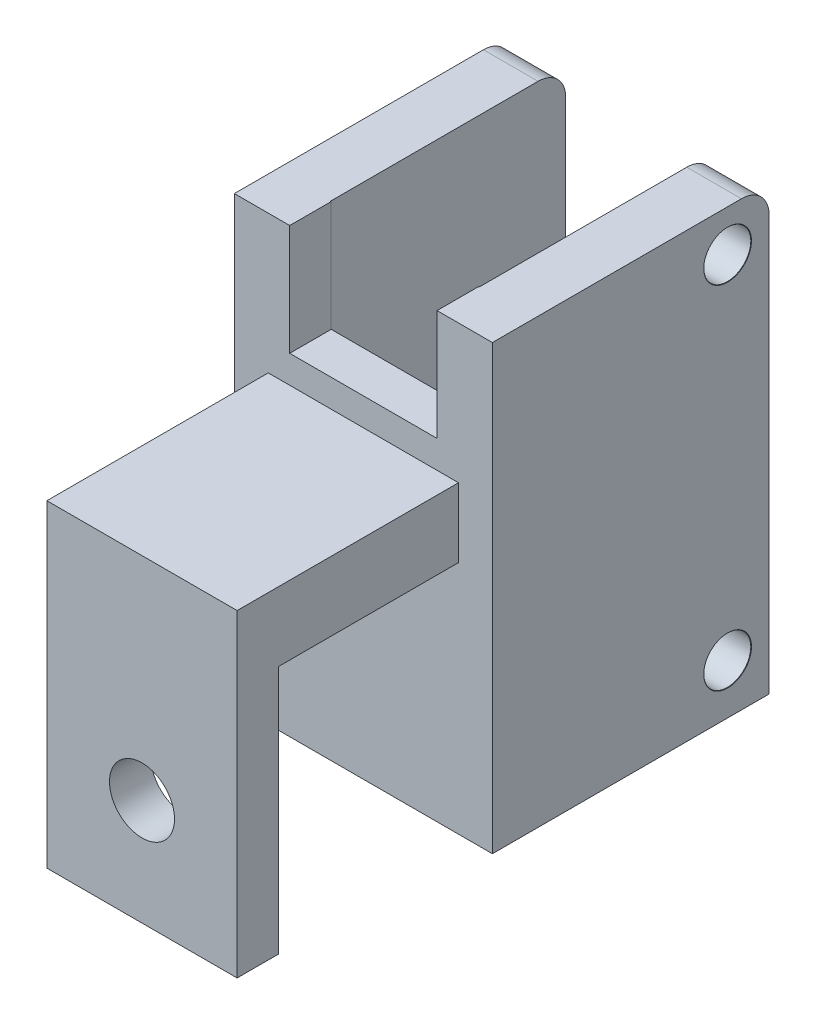
ISO-10303-21;
HEADER;
FILE_DESCRIPTION(('STEP AP214'),'2;1');
FILE_NAME('part.step','',(''),(''),'','','');
FILE_SCHEMA(('AUTOMOTIVE_DESIGN { 1 0 10303 214 1 1 1 1 }'));
ENDSEC;
DATA;
#1=APPLICATION_CONTEXT('core data for automotive mechanical design processes');
#2=APPLICATION_PROTOCOL_DEFINITION('international standard','automotive_design',2000,#1);
#3=PRODUCT_CONTEXT('',#1,'mechanical');
#4=PRODUCT('Part','Part','',(#3));
#5=PRODUCT_RELATED_PRODUCT_CATEGORY('part','',(#4));
#6=PRODUCT_DEFINITION_FORMATION('','',#4);
#7=PRODUCT_DEFINITION_CONTEXT('part definition',#1,'design');
#8=PRODUCT_DEFINITION('design','',#6,#7);
#9=PRODUCT_DEFINITION_SHAPE('','',#8);
#10=(LENGTH_UNIT() NAMED_UNIT(*) SI_UNIT(.MILLI.,.METRE.));
#11=(NAMED_UNIT(*) PLANE_ANGLE_UNIT() SI_UNIT($,.RADIAN.));
#12=(NAMED_UNIT(*) SI_UNIT($,.STERADIAN.) SOLID_ANGLE_UNIT());
#13=UNCERTAINTY_MEASURE_WITH_UNIT(LENGTH_MEASURE(1.E-05),#10,'distance_accuracy_value','');
#14=(GEOMETRIC_REPRESENTATION_CONTEXT(3) GLOBAL_UNCERTAINTY_ASSIGNED_CONTEXT((#13)) GLOBAL_UNIT_ASSIGNED_CONTEXT((#10,
#11,#12)) REPRESENTATION_CONTEXT('',''));
#15=CARTESIAN_POINT('',(0.,0.,0.));
#16=DIRECTION('',(0.,0.,1.));
#17=DIRECTION('',(1.,0.,0.));
#18=AXIS2_PLACEMENT_3D('',#15,#16,#17);
#19=CARTESIAN_POINT('',(-6.875,1.,16.));
#20=DIRECTION('',(0.,1.,0.));
#21=DIRECTION('',(0.,0.,1.));
#22=AXIS2_PLACEMENT_3D('',#19,#20,#21);
#23=PLANE('',#22);
#24=DIRECTION('',(1.,0.,0.));
#25=VECTOR('',#24,1.);
#26=CARTESIAN_POINT('',(-6.875,1.,13.));
#27=LINE('',#26,#25);
#28=CARTESIAN_POINT('',(-6.875,1.,13.));
#29=VERTEX_POINT('',#28);
#30=CARTESIAN_POINT('',(6.875,1.,13.));
#31=VERTEX_POINT('',#30);
#32=EDGE_CURVE('E208',#29,#31,#27,.T.);
#33=ORIENTED_EDGE('',*,*,#32,.F.);
#34=DIRECTION('',(0.,0.,-1.));
#35=VECTOR('',#34,1.);
#36=CARTESIAN_POINT('',(-6.875,1.,16.));
#37=LINE('',#36,#35);
#38=CARTESIAN_POINT('',(-6.875,1.,0.));
#39=VERTEX_POINT('',#38);
#40=EDGE_CURVE('E213',#29,#39,#37,.T.);
#41=ORIENTED_EDGE('',*,*,#40,.T.);
#42=DIRECTION('',(1.,0.,0.));
#43=VECTOR('',#42,1.);
#44=CARTESIAN_POINT('',(-6.875,1.,0.));
#45=LINE('',#44,#43);
#46=CARTESIAN_POINT('',(6.875,1.,0.));
#47=VERTEX_POINT('',#46);
#48=EDGE_CURVE('E219',#39,#47,#45,.T.);
#49=ORIENTED_EDGE('',*,*,#48,.T.);
#50=DIRECTION('',(0.,0.,-1.));
#51=VECTOR('',#50,1.);
#52=CARTESIAN_POINT('',(6.875,1.,16.));
#53=LINE('',#52,#51);
#54=EDGE_CURVE('E248',#31,#47,#53,.T.);
#55=ORIENTED_EDGE('',*,*,#54,.F.);
#56=EDGE_LOOP('',(#33,#41,#49,#55));
#57=FACE_BOUND('',#56,.T.);
#58=ADVANCED_FACE('F47',(#57),#23,.F.);
#59=CARTESIAN_POINT('',(0.,0.,0.));
#60=DIRECTION('',(0.,0.,1.));
#61=DIRECTION('',(1.,0.,0.));
#62=AXIS2_PLACEMENT_3D('',#59,#60,#61);
#63=PLANE('',#62);
#64=DIRECTION('',(0.,-1.,0.));
#65=VECTOR('',#64,1.);
#66=CARTESIAN_POINT('',(-5.325,16.,0.));
#67=LINE('',#66,#65);
#68=CARTESIAN_POINT('',(-5.325,16.,0.));
#69=VERTEX_POINT('',#68);
#70=CARTESIAN_POINT('',(-5.325,8.,0.));
#71=VERTEX_POINT('',#70);
#72=EDGE_CURVE('E283',#69,#71,#67,.T.);
#73=ORIENTED_EDGE('',*,*,#72,.F.);
#74=DIRECTION('',(-1.,0.,0.));
#75=VECTOR('',#74,1.);
#76=CARTESIAN_POINT('',(9.325,16.,0.));
#77=LINE('',#76,#75);
#78=CARTESIAN_POINT('',(-9.325,16.,0.));
#79=VERTEX_POINT('',#78);
#80=EDGE_CURVE('E374',#69,#79,#77,.T.);
#81=ORIENTED_EDGE('',*,*,#80,.T.);
#82=DIRECTION('',(0.,-1.,0.));
#83=VECTOR('',#82,1.);
#84=CARTESIAN_POINT('',(-9.325,-16.,0.));
#85=LINE('',#84,#83);
#86=CARTESIAN_POINT('',(-9.325,-16.,0.));
#87=VERTEX_POINT('',#86);
#88=EDGE_CURVE('E339',#79,#87,#85,.T.);
#89=ORIENTED_EDGE('',*,*,#88,.T.);
#90=DIRECTION('',(1.,0.,0.));
#91=VECTOR('',#90,1.);
#92=CARTESIAN_POINT('',(9.325,-16.,0.));
#93=LINE('',#92,#91);
#94=CARTESIAN_POINT('',(9.325,-16.,0.));
#95=VERTEX_POINT('',#94);
#96=EDGE_CURVE('E366',#87,#95,#93,.T.);
#97=ORIENTED_EDGE('',*,*,#96,.T.);
#98=DIRECTION('',(0.,1.,0.));
#99=VECTOR('',#98,1.);
#100=CARTESIAN_POINT('',(9.325,-16.,0.));
#101=LINE('',#100,#99);
#102=CARTESIAN_POINT('',(9.325,16.,0.));
#103=VERTEX_POINT('',#102);
#104=EDGE_CURVE('E370',#95,#103,#101,.T.);
#105=ORIENTED_EDGE('',*,*,#104,.T.);
#106=CARTESIAN_POINT('',(5.325,16.,0.));
#107=VERTEX_POINT('',#106);
#108=EDGE_CURVE('E354',#103,#107,#77,.T.);
#109=ORIENTED_EDGE('',*,*,#108,.T.);
#110=DIRECTION('',(0.,1.,0.));
#111=VECTOR('',#110,1.);
#112=CARTESIAN_POINT('',(5.325,16.,0.));
#113=LINE('',#112,#111);
#114=CARTESIAN_POINT('',(5.325,8.,0.));
#115=VERTEX_POINT('',#114);
#116=EDGE_CURVE('E291',#115,#107,#113,.T.);
#117=ORIENTED_EDGE('',*,*,#116,.F.);
#118=DIRECTION('',(1.,0.,0.));
#119=VECTOR('',#118,1.);
#120=CARTESIAN_POINT('',(-5.325,8.,0.));
#121=LINE('',#120,#119);
#122=EDGE_CURVE('E287',#71,#115,#121,.T.);
#123=ORIENTED_EDGE('',*,*,#122,.F.);
#124=EDGE_LOOP('',(#73,#81,#89,#97,#105,#109,#117,#123));
#125=FACE_BOUND('',#124,.T.);
#126=ORIENTED_EDGE('',*,*,#48,.F.);
#127=DIRECTION('',(0.,-1.,0.));
#128=VECTOR('',#127,1.);
#129=CARTESIAN_POINT('',(-6.875,6.,0.));
#130=LINE('',#129,#128);
#131=CARTESIAN_POINT('',(-6.875,6.,0.));
#132=VERTEX_POINT('',#131);
#133=EDGE_CURVE('E215',#132,#39,#130,.T.);
#134=ORIENTED_EDGE('',*,*,#133,.F.);
#135=DIRECTION('',(-1.,0.,0.));
#136=VECTOR('',#135,1.);
#137=CARTESIAN_POINT('',(-6.875,6.,0.));
#138=LINE('',#137,#136);
#139=CARTESIAN_POINT('',(6.875,6.,0.));
#140=VERTEX_POINT('',#139);
#141=EDGE_CURVE('E228',#140,#132,#138,.T.);
#142=ORIENTED_EDGE('',*,*,#141,.F.);
#143=DIRECTION('',(0.,1.,0.));
#144=VECTOR('',#143,1.);
#145=CARTESIAN_POINT('',(6.875,6.,0.));
#146=LINE('',#145,#144);
#147=EDGE_CURVE('E238',#47,#140,#146,.T.);
#148=ORIENTED_EDGE('',*,*,#147,.F.);
#149=EDGE_LOOP('',(#126,#134,#142,#148));
#150=FACE_BOUND('',#149,.T.);
#151=ADVANCED_FACE('F442',(#125,#150),#63,.T.);
#152=CARTESIAN_POINT('',(9.325,16.,-20.));
#153=DIRECTION('',(0.,1.,0.));
#154=DIRECTION('',(-1.,0.,0.));
#155=AXIS2_PLACEMENT_3D('',#152,#153,#154);
#156=PLANE('',#155);
#157=DIRECTION('',(0.,0.,-1.));
#158=VECTOR('',#157,1.);
#159=CARTESIAN_POINT('',(-5.375,16.,-3.));
#160=LINE('',#159,#158);
#161=CARTESIAN_POINT('',(-5.375,16.,-3.));
#162=VERTEX_POINT('',#161);
#163=CARTESIAN_POINT('',(-5.375,16.,-18.));
#164=VERTEX_POINT('',#163);
#165=EDGE_CURVE('E335',#162,#164,#160,.T.);
#166=ORIENTED_EDGE('',*,*,#165,.T.);
#167=DIRECTION('',(-1.,0.,0.));
#168=VECTOR('',#167,1.);
#169=CARTESIAN_POINT('',(-9.325,16.,-18.));
#170=LINE('',#169,#168);
#171=CARTESIAN_POINT('',(-9.325,16.,-18.));
#172=VERTEX_POINT('',#171);
#173=EDGE_CURVE('E381',#164,#172,#170,.T.);
#174=ORIENTED_EDGE('',*,*,#173,.T.);
#175=DIRECTION('',(0.,0.,1.));
#176=VECTOR('',#175,1.);
#177=CARTESIAN_POINT('',(-9.325,16.,-20.));
#178=LINE('',#177,#176);
#179=EDGE_CURVE('E378',#172,#79,#178,.T.);
#180=ORIENTED_EDGE('',*,*,#179,.T.);
#181=ORIENTED_EDGE('',*,*,#80,.F.);
#182=DIRECTION('',(0.,0.,1.));
#183=VECTOR('',#182,1.);
#184=CARTESIAN_POINT('',(-5.325,16.,-20.001));
#185=LINE('',#184,#183);
#186=CARTESIAN_POINT('',(-5.325,16.,-3.));
#187=VERTEX_POINT('',#186);
#188=EDGE_CURVE('E295',#187,#69,#185,.T.);
#189=ORIENTED_EDGE('',*,*,#188,.F.);
#190=DIRECTION('',(1.,0.,0.));
#191=VECTOR('',#190,1.);
#192=CARTESIAN_POINT('',(5.375,16.,-3.));
#193=LINE('',#192,#191);
#194=EDGE_CURVE('E312',#162,#187,#193,.T.);
#195=ORIENTED_EDGE('',*,*,#194,.F.);
#196=EDGE_LOOP('',(#166,#174,#180,#181,#189,#195));
#197=FACE_BOUND('',#196,.T.);
#198=ADVANCED_FACE('F462',(#197),#156,.T.);
#199=CARTESIAN_POINT('',(0.,0.,-20.));
#200=DIRECTION('',(0.,0.,1.));
#201=DIRECTION('',(1.,0.,0.));
#202=AXIS2_PLACEMENT_3D('',#199,#200,#201);
#203=PLANE('',#202);
#204=DIRECTION('',(0.,-1.,0.));
#205=VECTOR('',#204,1.);
#206=CARTESIAN_POINT('',(-9.325,-16.,-20.));
#207=LINE('',#206,#205);
#208=CARTESIAN_POINT('',(-9.325,14.,-20.));
#209=VERTEX_POINT('',#208);
#210=CARTESIAN_POINT('',(-9.325,-16.,-20.));
#211=VERTEX_POINT('',#210);
#212=EDGE_CURVE('E350',#209,#211,#207,.T.);
#213=ORIENTED_EDGE('',*,*,#212,.F.);
#214=DIRECTION('',(-1.,0.,0.));
#215=VECTOR('',#214,1.);
#216=CARTESIAN_POINT('',(-5.375,14.,-20.));
#217=LINE('',#216,#215);
#218=CARTESIAN_POINT('',(-5.375,14.,-20.));
#219=VERTEX_POINT('',#218);
#220=EDGE_CURVE('E396',#209,#219,#217,.F.);
#221=ORIENTED_EDGE('',*,*,#220,.T.);
#222=DIRECTION('',(0.,1.,0.));
#223=VECTOR('',#222,1.);
#224=CARTESIAN_POINT('',(-5.375,16.,-20.));
#225=LINE('',#224,#223);
#226=CARTESIAN_POINT('',(-5.375,-16.,-20.));
#227=VERTEX_POINT('',#226);
#228=EDGE_CURVE('E331',#227,#219,#225,.T.);
#229=ORIENTED_EDGE('',*,*,#228,.F.);
#230=DIRECTION('',(1.,0.,0.));
#231=VECTOR('',#230,1.);
#232=CARTESIAN_POINT('',(9.325,-16.,-20.));
#233=LINE('',#232,#231);
#234=EDGE_CURVE('E355',#211,#227,#233,.T.);
#235=ORIENTED_EDGE('',*,*,#234,.F.);
#236=EDGE_LOOP('',(#213,#221,#229,#235));
#237=FACE_BOUND('',#236,.T.);
#238=ADVANCED_FACE('F451',(#237),#203,.F.);
#239=CARTESIAN_POINT('',(-9.325,-16.,-20.));
#240=DIRECTION('',(-1.,0.,0.));
#241=DIRECTION('',(0.,0.,1.));
#242=AXIS2_PLACEMENT_3D('',#239,#240,#241);
#243=PLANE('',#242);
#244=ORIENTED_EDGE('',*,*,#179,.F.);
#245=CARTESIAN_POINT('',(-9.325,14.,-18.));
#246=DIRECTION('',(-1.,0.,0.));
#247=DIRECTION('',(0.,0.,1.));
#248=AXIS2_PLACEMENT_3D('',#245,#246,#247);
#249=CIRCLE('',#248,2.);
#250=EDGE_CURVE('E393',#172,#209,#249,.T.);
#251=ORIENTED_EDGE('',*,*,#250,.T.);
#252=ORIENTED_EDGE('',*,*,#212,.T.);
#253=DIRECTION('',(0.,0.,1.));
#254=VECTOR('',#253,1.);
#255=CARTESIAN_POINT('',(-9.325,-16.,-20.));
#256=LINE('',#255,#254);
#257=EDGE_CURVE('E362',#211,#87,#256,.T.);
#258=ORIENTED_EDGE('',*,*,#257,.T.);
#259=ORIENTED_EDGE('',*,*,#88,.F.);
#260=EDGE_LOOP('',(#244,#251,#252,#258,#259));
#261=FACE_BOUND('',#260,.T.);
#262=ADVANCED_FACE('F465',(#261),#243,.T.);
#263=DIRECTION('',(0.,0.,1.));
#264=VECTOR('',#263,1.);
#265=CARTESIAN_POINT('',(9.325,16.,-20.));
#266=LINE('',#265,#264);
#267=CARTESIAN_POINT('',(9.325,16.,-18.));
#268=VERTEX_POINT('',#267);
#269=EDGE_CURVE('E382',#268,#103,#266,.T.);
#270=ORIENTED_EDGE('',*,*,#269,.F.);
#271=DIRECTION('',(-1.,0.,0.));
#272=VECTOR('',#271,1.);
#273=CARTESIAN_POINT('',(5.375,16.,-18.));
#274=LINE('',#273,#272);
#275=CARTESIAN_POINT('',(5.375,16.,-18.));
#276=VERTEX_POINT('',#275);
#277=EDGE_CURVE('E402',#268,#276,#274,.T.);
#278=ORIENTED_EDGE('',*,*,#277,.T.);
#279=DIRECTION('',(0.,0.,-1.));
#280=VECTOR('',#279,1.);
#281=CARTESIAN_POINT('',(5.375,16.,-3.));
#282=LINE('',#281,#280);
#283=CARTESIAN_POINT('',(5.375,16.,-3.));
#284=VERTEX_POINT('',#283);
#285=EDGE_CURVE('E328',#284,#276,#282,.T.);
#286=ORIENTED_EDGE('',*,*,#285,.F.);
#287=CARTESIAN_POINT('',(5.325,16.,-3.));
#288=VERTEX_POINT('',#287);
#289=EDGE_CURVE('E317',#288,#284,#193,.T.);
#290=ORIENTED_EDGE('',*,*,#289,.F.);
#291=DIRECTION('',(0.,0.,1.));
#292=VECTOR('',#291,1.);
#293=CARTESIAN_POINT('',(5.325,16.,-20.001));
#294=LINE('',#293,#292);
#295=EDGE_CURVE('E299',#288,#107,#294,.T.);
#296=ORIENTED_EDGE('',*,*,#295,.T.);
#297=ORIENTED_EDGE('',*,*,#108,.F.);
#298=EDGE_LOOP('',(#270,#278,#286,#290,#296,#297));
#299=FACE_BOUND('',#298,.T.);
#300=ADVANCED_FACE('F425',(#299),#156,.T.);
#301=CARTESIAN_POINT('',(9.325,-16.,-20.));
#302=DIRECTION('',(1.,0.,0.));
#303=DIRECTION('',(0.,0.,-1.));
#304=AXIS2_PLACEMENT_3D('',#301,#302,#303);
#305=PLANE('',#304);
#306=CARTESIAN_POINT('',(9.325,13.,-17.));
#307=DIRECTION('',(1.,0.,0.));
#308=DIRECTION('',(0.,0.,-1.));
#309=AXIS2_PLACEMENT_3D('',#306,#307,#308);
#310=CIRCLE('',#309,1.725);
#311=CARTESIAN_POINT('',(9.325,13.,-18.725));
#312=VERTEX_POINT('',#311);
#313=EDGE_CURVE('E253',#312,#312,#310,.T.);
#314=ORIENTED_EDGE('',*,*,#313,.F.);
#315=EDGE_LOOP('',(#314));
#316=FACE_BOUND('',#315,.T.);
#317=CARTESIAN_POINT('',(9.325,-12.4,-17.));
#318=DIRECTION('',(1.,0.,0.));
#319=DIRECTION('',(0.,0.,-1.));
#320=AXIS2_PLACEMENT_3D('',#317,#318,#319);
#321=CIRCLE('',#320,1.725);
#322=CARTESIAN_POINT('',(9.325,-12.4,-18.725));
#323=VERTEX_POINT('',#322);
#324=EDGE_CURVE('E265',#323,#323,#321,.T.);
#325=ORIENTED_EDGE('',*,*,#324,.F.);
#326=EDGE_LOOP('',(#325));
#327=FACE_BOUND('',#326,.T.);
#328=DIRECTION('',(0.,1.,0.));
#329=VECTOR('',#328,1.);
#330=CARTESIAN_POINT('',(9.325,-16.,-20.));
#331=LINE('',#330,#329);
#332=CARTESIAN_POINT('',(9.325,-16.,-20.));
#333=VERTEX_POINT('',#332);
#334=CARTESIAN_POINT('',(9.325,14.,-20.));
#335=VERTEX_POINT('',#334);
#336=EDGE_CURVE('E359',#333,#335,#331,.T.);
#337=ORIENTED_EDGE('',*,*,#336,.T.);
#338=CARTESIAN_POINT('',(9.325,14.,-18.));
#339=DIRECTION('',(1.,0.,0.));
#340=DIRECTION('',(0.,0.,-1.));
#341=AXIS2_PLACEMENT_3D('',#338,#339,#340);
#342=CIRCLE('',#341,2.);
#343=EDGE_CURVE('E11',#335,#268,#342,.T.);
#344=ORIENTED_EDGE('',*,*,#343,.T.);
#345=ORIENTED_EDGE('',*,*,#269,.T.);
#346=ORIENTED_EDGE('',*,*,#104,.F.);
#347=DIRECTION('',(0.,0.,1.));
#348=VECTOR('',#347,1.);
#349=CARTESIAN_POINT('',(9.325,-16.,-20.));
#350=LINE('',#349,#348);
#351=EDGE_CURVE('E385',#333,#95,#350,.T.);
#352=ORIENTED_EDGE('',*,*,#351,.F.);
#353=EDGE_LOOP('',(#337,#344,#345,#346,#352));
#354=FACE_BOUND('',#353,.T.);
#355=ADVANCED_FACE('F439',(#316,#327,#354),#305,.T.);
#356=CARTESIAN_POINT('',(9.325,-16.,-20.));
#357=DIRECTION('',(0.,-1.,0.));
#358=DIRECTION('',(1.,0.,0.));
#359=AXIS2_PLACEMENT_3D('',#356,#357,#358);
#360=PLANE('',#359);
#361=DIRECTION('',(0.,0.,-1.));
#362=VECTOR('',#361,1.);
#363=CARTESIAN_POINT('',(-5.375,-16.,-3.));
#364=LINE('',#363,#362);
#365=CARTESIAN_POINT('',(-5.375,-16.,-3.));
#366=VERTEX_POINT('',#365);
#367=EDGE_CURVE('E340',#366,#227,#364,.T.);
#368=ORIENTED_EDGE('',*,*,#367,.F.);
#369=DIRECTION('',(-1.,0.,0.));
#370=VECTOR('',#369,1.);
#371=CARTESIAN_POINT('',(5.375,-16.,-3.));
#372=LINE('',#371,#370);
#373=CARTESIAN_POINT('',(5.375,-16.,-3.));
#374=VERTEX_POINT('',#373);
#375=EDGE_CURVE('E321',#374,#366,#372,.T.);
#376=ORIENTED_EDGE('',*,*,#375,.F.);
#377=DIRECTION('',(0.,0.,-1.));
#378=VECTOR('',#377,1.);
#379=CARTESIAN_POINT('',(5.375,-16.,-3.));
#380=LINE('',#379,#378);
#381=CARTESIAN_POINT('',(5.375,-16.,-20.));
#382=VERTEX_POINT('',#381);
#383=EDGE_CURVE('E343',#374,#382,#380,.T.);
#384=ORIENTED_EDGE('',*,*,#383,.T.);
#385=EDGE_CURVE('E353',#382,#333,#233,.T.);
#386=ORIENTED_EDGE('',*,*,#385,.T.);
#387=ORIENTED_EDGE('',*,*,#351,.T.);
#388=ORIENTED_EDGE('',*,*,#96,.F.);
#389=ORIENTED_EDGE('',*,*,#257,.F.);
#390=ORIENTED_EDGE('',*,*,#234,.T.);
#391=EDGE_LOOP('',(#368,#376,#384,#386,#387,#388,#389,#390));
#392=FACE_BOUND('',#391,.T.);
#393=ADVANCED_FACE('F435',(#392),#360,.T.);
#394=DIRECTION('',(0.,-1.,0.));
#395=VECTOR('',#394,1.);
#396=CARTESIAN_POINT('',(5.375,16.,-20.));
#397=LINE('',#396,#395);
#398=CARTESIAN_POINT('',(5.375,14.,-20.));
#399=VERTEX_POINT('',#398);
#400=EDGE_CURVE('E311',#399,#382,#397,.T.);
#401=ORIENTED_EDGE('',*,*,#400,.F.);
#402=DIRECTION('',(-1.,0.,0.));
#403=VECTOR('',#402,1.);
#404=CARTESIAN_POINT('',(9.325,14.,-20.));
#405=LINE('',#404,#403);
#406=EDGE_CURVE('E56',#399,#335,#405,.F.);
#407=ORIENTED_EDGE('',*,*,#406,.T.);
#408=ORIENTED_EDGE('',*,*,#336,.F.);
#409=ORIENTED_EDGE('',*,*,#385,.F.);
#410=EDGE_LOOP('',(#401,#407,#408,#409));
#411=FACE_BOUND('',#410,.T.);
#412=ADVANCED_FACE('F431',(#411),#203,.F.);
#413=CARTESIAN_POINT('',(-5.375,16.,-3.));
#414=DIRECTION('',(-1.,0.,0.));
#415=DIRECTION('',(0.,0.,1.));
#416=AXIS2_PLACEMENT_3D('',#413,#414,#415);
#417=PLANE('',#416);
#418=ORIENTED_EDGE('',*,*,#228,.T.);
#419=CARTESIAN_POINT('',(-5.375,14.,-18.));
#420=DIRECTION('',(-1.,0.,0.));
#421=DIRECTION('',(0.,0.,1.));
#422=AXIS2_PLACEMENT_3D('',#419,#420,#421);
#423=CIRCLE('',#422,2.);
#424=EDGE_CURVE('E399',#219,#164,#423,.F.);
#425=ORIENTED_EDGE('',*,*,#424,.T.);
#426=ORIENTED_EDGE('',*,*,#165,.F.);
#427=DIRECTION('',(0.,1.,0.));
#428=VECTOR('',#427,1.);
#429=CARTESIAN_POINT('',(-5.375,16.,-3.));
#430=LINE('',#429,#428);
#431=EDGE_CURVE('E324',#366,#162,#430,.T.);
#432=ORIENTED_EDGE('',*,*,#431,.F.);
#433=ORIENTED_EDGE('',*,*,#367,.T.);
#434=EDGE_LOOP('',(#418,#425,#426,#432,#433));
#435=FACE_BOUND('',#434,.T.);
#436=ADVANCED_FACE('F455',(#435),#417,.F.);
#437=CARTESIAN_POINT('',(5.375,16.,-3.));
#438=DIRECTION('',(1.,0.,0.));
#439=DIRECTION('',(0.,0.,-1.));
#440=AXIS2_PLACEMENT_3D('',#437,#438,#439);
#441=PLANE('',#440);
#442=CARTESIAN_POINT('',(5.375,13.,-17.));
#443=DIRECTION('',(1.,0.,0.));
#444=DIRECTION('',(0.,0.,-1.));
#445=AXIS2_PLACEMENT_3D('',#442,#443,#444);
#446=CIRCLE('',#445,1.7);
#447=CARTESIAN_POINT('',(5.375,13.,-18.7));
#448=VERTEX_POINT('',#447);
#449=EDGE_CURVE('E261',#448,#448,#446,.T.);
#450=ORIENTED_EDGE('',*,*,#449,.T.);
#451=EDGE_LOOP('',(#450));
#452=FACE_BOUND('',#451,.T.);
#453=CARTESIAN_POINT('',(5.375,-12.4,-17.));
#454=DIRECTION('',(1.,0.,0.));
#455=DIRECTION('',(0.,0.,-1.));
#456=AXIS2_PLACEMENT_3D('',#453,#454,#455);
#457=CIRCLE('',#456,1.7);
#458=CARTESIAN_POINT('',(5.375,-12.4,-18.7));
#459=VERTEX_POINT('',#458);
#460=EDGE_CURVE('E273',#459,#459,#457,.T.);
#461=ORIENTED_EDGE('',*,*,#460,.T.);
#462=EDGE_LOOP('',(#461));
#463=FACE_BOUND('',#462,.T.);
#464=ORIENTED_EDGE('',*,*,#285,.T.);
#465=CARTESIAN_POINT('',(5.375,14.,-18.));
#466=DIRECTION('',(1.,0.,0.));
#467=DIRECTION('',(0.,0.,-1.));
#468=AXIS2_PLACEMENT_3D('',#465,#466,#467);
#469=CIRCLE('',#468,2.);
#470=EDGE_CURVE('E406',#276,#399,#469,.F.);
#471=ORIENTED_EDGE('',*,*,#470,.T.);
#472=ORIENTED_EDGE('',*,*,#400,.T.);
#473=ORIENTED_EDGE('',*,*,#383,.F.);
#474=DIRECTION('',(0.,-1.,0.));
#475=VECTOR('',#474,1.);
#476=CARTESIAN_POINT('',(5.375,16.,-3.));
#477=LINE('',#476,#475);
#478=EDGE_CURVE('E316',#284,#374,#477,.T.);
#479=ORIENTED_EDGE('',*,*,#478,.F.);
#480=EDGE_LOOP('',(#464,#471,#472,#473,#479));
#481=FACE_BOUND('',#480,.T.);
#482=ADVANCED_FACE('F423',(#452,#463,#481),#441,.F.);
#483=CARTESIAN_POINT('',(0.,0.,-3.));
#484=DIRECTION('',(0.,0.,1.));
#485=DIRECTION('',(1.,0.,0.));
#486=AXIS2_PLACEMENT_3D('',#483,#484,#485);
#487=PLANE('',#486);
#488=ORIENTED_EDGE('',*,*,#194,.T.);
#489=DIRECTION('',(0.,1.,0.));
#490=VECTOR('',#489,1.);
#491=CARTESIAN_POINT('',(-5.325,16.,-3.));
#492=LINE('',#491,#490);
#493=CARTESIAN_POINT('',(-5.325,8.,-3.));
#494=VERTEX_POINT('',#493);
#495=EDGE_CURVE('E280',#494,#187,#492,.T.);
#496=ORIENTED_EDGE('',*,*,#495,.F.);
#497=DIRECTION('',(-1.,0.,0.));
#498=VECTOR('',#497,1.);
#499=CARTESIAN_POINT('',(-5.325,8.,-3.));
#500=LINE('',#499,#498);
#501=CARTESIAN_POINT('',(5.325,8.,-3.));
#502=VERTEX_POINT('',#501);
#503=EDGE_CURVE('E298',#502,#494,#500,.T.);
#504=ORIENTED_EDGE('',*,*,#503,.F.);
#505=DIRECTION('',(0.,-1.,0.));
#506=VECTOR('',#505,1.);
#507=CARTESIAN_POINT('',(5.325,16.,-3.));
#508=LINE('',#507,#506);
#509=EDGE_CURVE('E277',#288,#502,#508,.T.);
#510=ORIENTED_EDGE('',*,*,#509,.F.);
#511=ORIENTED_EDGE('',*,*,#289,.T.);
#512=ORIENTED_EDGE('',*,*,#478,.T.);
#513=ORIENTED_EDGE('',*,*,#375,.T.);
#514=ORIENTED_EDGE('',*,*,#431,.T.);
#515=EDGE_LOOP('',(#488,#496,#504,#510,#511,#512,#513,#514));
#516=FACE_BOUND('',#515,.T.);
#517=ADVANCED_FACE('F417',(#516),#487,.F.);
#518=CARTESIAN_POINT('',(-5.325,16.,-20.001));
#519=DIRECTION('',(-1.,0.,0.));
#520=DIRECTION('',(0.,-1.,0.));
#521=AXIS2_PLACEMENT_3D('',#518,#519,#520);
#522=PLANE('',#521);
#523=ORIENTED_EDGE('',*,*,#495,.T.);
#524=ORIENTED_EDGE('',*,*,#188,.T.);
#525=ORIENTED_EDGE('',*,*,#72,.T.);
#526=DIRECTION('',(0.,0.,1.));
#527=VECTOR('',#526,1.);
#528=CARTESIAN_POINT('',(-5.325,8.,-20.001));
#529=LINE('',#528,#527);
#530=EDGE_CURVE('E294',#494,#71,#529,.T.);
#531=ORIENTED_EDGE('',*,*,#530,.F.);
#532=EDGE_LOOP('',(#523,#524,#525,#531));
#533=FACE_BOUND('',#532,.T.);
#534=ADVANCED_FACE('F509',(#533),#522,.F.);
#535=CARTESIAN_POINT('',(5.325,16.,-20.001));
#536=DIRECTION('',(1.,0.,0.));
#537=DIRECTION('',(0.,1.,0.));
#538=AXIS2_PLACEMENT_3D('',#535,#536,#537);
#539=PLANE('',#538);
#540=ORIENTED_EDGE('',*,*,#509,.T.);
#541=DIRECTION('',(0.,0.,1.));
#542=VECTOR('',#541,1.);
#543=CARTESIAN_POINT('',(5.325,8.,-20.001));
#544=LINE('',#543,#542);
#545=EDGE_CURVE('E303',#502,#115,#544,.T.);
#546=ORIENTED_EDGE('',*,*,#545,.T.);
#547=ORIENTED_EDGE('',*,*,#116,.T.);
#548=ORIENTED_EDGE('',*,*,#295,.F.);
#549=EDGE_LOOP('',(#540,#546,#547,#548));
#550=FACE_BOUND('',#549,.T.);
#551=ADVANCED_FACE('F505',(#550),#539,.F.);
#552=CARTESIAN_POINT('',(-5.325,8.,-20.001));
#553=DIRECTION('',(0.,-1.,0.));
#554=DIRECTION('',(0.,0.,-1.));
#555=AXIS2_PLACEMENT_3D('',#552,#553,#554);
#556=PLANE('',#555);
#557=ORIENTED_EDGE('',*,*,#503,.T.);
#558=ORIENTED_EDGE('',*,*,#530,.T.);
#559=ORIENTED_EDGE('',*,*,#122,.T.);
#560=ORIENTED_EDGE('',*,*,#545,.F.);
#561=EDGE_LOOP('',(#557,#558,#559,#560));
#562=FACE_BOUND('',#561,.T.);
#563=ADVANCED_FACE('F508',(#562),#556,.F.);
#564=CARTESIAN_POINT('',(9.325,14.,-18.));
#565=DIRECTION('',(1.,0.,0.));
#566=DIRECTION('',(0.,1.,0.));
#567=AXIS2_PLACEMENT_3D('',#564,#565,#566);
#568=CYLINDRICAL_SURFACE('',#567,2.);
#569=ORIENTED_EDGE('',*,*,#424,.F.);
#570=ORIENTED_EDGE('',*,*,#220,.F.);
#571=ORIENTED_EDGE('',*,*,#250,.F.);
#572=ORIENTED_EDGE('',*,*,#173,.F.);
#573=EDGE_LOOP('',(#569,#570,#571,#572));
#574=FACE_BOUND('',#573,.T.);
#575=ADVANCED_FACE('F459',(#574),#568,.T.);
#576=CARTESIAN_POINT('',(9.325,14.,-18.));
#577=DIRECTION('',(1.,0.,0.));
#578=DIRECTION('',(0.,1.,0.));
#579=AXIS2_PLACEMENT_3D('',#576,#577,#578);
#580=CYLINDRICAL_SURFACE('',#579,2.);
#581=ORIENTED_EDGE('',*,*,#343,.F.);
#582=ORIENTED_EDGE('',*,*,#406,.F.);
#583=ORIENTED_EDGE('',*,*,#470,.F.);
#584=ORIENTED_EDGE('',*,*,#277,.F.);
#585=EDGE_LOOP('',(#581,#582,#583,#584));
#586=FACE_BOUND('',#585,.T.);
#587=ADVANCED_FACE('F49',(#586),#580,.T.);
#588=CARTESIAN_POINT('',(9.325,-12.4,-17.));
#589=DIRECTION('',(1.,0.,0.));
#590=DIRECTION('',(0.,0.,-1.));
#591=AXIS2_PLACEMENT_3D('',#588,#589,#590);
#592=CYLINDRICAL_SURFACE('',#591,1.7);
#593=ORIENTED_EDGE('',*,*,#460,.F.);
#594=EDGE_LOOP('',(#593));
#595=FACE_BOUND('',#594,.T.);
#596=CARTESIAN_POINT('',(9.30085778062982,-12.4,-17.));
#597=DIRECTION('',(1.,0.,0.));
#598=DIRECTION('',(0.,0.,-1.));
#599=AXIS2_PLACEMENT_3D('',#596,#597,#598);
#600=CIRCLE('',#599,1.7);
#601=CARTESIAN_POINT('',(9.30085778062982,-12.4,-18.7));
#602=VERTEX_POINT('',#601);
#603=EDGE_CURVE('E269',#602,#602,#600,.T.);
#604=ORIENTED_EDGE('',*,*,#603,.T.);
#605=EDGE_LOOP('',(#604));
#606=FACE_BOUND('',#605,.T.);
#607=ADVANCED_FACE('F500',(#595,#606),#592,.F.);
#608=CARTESIAN_POINT('',(9.325,-12.4,-17.));
#609=DIRECTION('',(1.,0.,0.));
#610=DIRECTION('',(0.,0.,-1.));
#611=AXIS2_PLACEMENT_3D('',#608,#609,#610);
#612=CONICAL_SURFACE('',#611,1.725,0.80285145591735);
#613=ORIENTED_EDGE('',*,*,#603,.F.);
#614=EDGE_LOOP('',(#613));
#615=FACE_BOUND('',#614,.T.);
#616=ORIENTED_EDGE('',*,*,#324,.T.);
#617=EDGE_LOOP('',(#616));
#618=FACE_BOUND('',#617,.T.);
#619=ADVANCED_FACE('F496',(#615,#618),#612,.F.);
#620=CARTESIAN_POINT('',(9.325,13.,-17.));
#621=DIRECTION('',(1.,0.,0.));
#622=DIRECTION('',(0.,0.,-1.));
#623=AXIS2_PLACEMENT_3D('',#620,#621,#622);
#624=CYLINDRICAL_SURFACE('',#623,1.7);
#625=ORIENTED_EDGE('',*,*,#449,.F.);
#626=EDGE_LOOP('',(#625));
#627=FACE_BOUND('',#626,.T.);
#628=CARTESIAN_POINT('',(9.30085778062982,13.,-17.));
#629=DIRECTION('',(1.,0.,0.));
#630=DIRECTION('',(0.,0.,-1.));
#631=AXIS2_PLACEMENT_3D('',#628,#629,#630);
#632=CIRCLE('',#631,1.7);
#633=CARTESIAN_POINT('',(9.30085778062982,13.,-18.7));
#634=VERTEX_POINT('',#633);
#635=EDGE_CURVE('E257',#634,#634,#632,.T.);
#636=ORIENTED_EDGE('',*,*,#635,.T.);
#637=EDGE_LOOP('',(#636));
#638=FACE_BOUND('',#637,.T.);
#639=ADVANCED_FACE('F492',(#627,#638),#624,.F.);
#640=CARTESIAN_POINT('',(9.325,13.,-17.));
#641=DIRECTION('',(1.,0.,0.));
#642=DIRECTION('',(0.,0.,-1.));
#643=AXIS2_PLACEMENT_3D('',#640,#641,#642);
#644=CONICAL_SURFACE('',#643,1.725,0.80285145591735);
#645=ORIENTED_EDGE('',*,*,#635,.F.);
#646=EDGE_LOOP('',(#645));
#647=FACE_BOUND('',#646,.T.);
#648=ORIENTED_EDGE('',*,*,#313,.T.);
#649=EDGE_LOOP('',(#648));
#650=FACE_BOUND('',#649,.T.);
#651=ADVANCED_FACE('F489',(#647,#650),#644,.F.);
#652=CARTESIAN_POINT('',(-6.875,6.,16.));
#653=DIRECTION('',(1.,0.,0.));
#654=DIRECTION('',(0.,0.,-1.));
#655=AXIS2_PLACEMENT_3D('',#652,#653,#654);
#656=PLANE('',#655);
#657=ORIENTED_EDGE('',*,*,#133,.T.);
#658=ORIENTED_EDGE('',*,*,#40,.F.);
#659=DIRECTION('',(0.,1.,0.));
#660=VECTOR('',#659,1.);
#661=CARTESIAN_POINT('',(-6.875,-17.,13.));
#662=LINE('',#661,#660);
#663=CARTESIAN_POINT('',(-6.875,-17.,13.));
#664=VERTEX_POINT('',#663);
#665=EDGE_CURVE('E189',#664,#29,#662,.T.);
#666=ORIENTED_EDGE('',*,*,#665,.F.);
#667=DIRECTION('',(0.,0.,-1.));
#668=VECTOR('',#667,1.);
#669=CARTESIAN_POINT('',(-6.875,-17.,16.));
#670=LINE('',#669,#668);
#671=CARTESIAN_POINT('',(-6.875,-17.,16.));
#672=VERTEX_POINT('',#671);
#673=EDGE_CURVE('E198',#672,#664,#670,.T.);
#674=ORIENTED_EDGE('',*,*,#673,.F.);
#675=DIRECTION('',(0.,-1.,0.));
#676=VECTOR('',#675,1.);
#677=CARTESIAN_POINT('',(-6.875,6.,16.));
#678=LINE('',#677,#676);
#679=CARTESIAN_POINT('',(-6.875,6.,16.));
#680=VERTEX_POINT('',#679);
#681=EDGE_CURVE('E224',#680,#672,#678,.T.);
#682=ORIENTED_EDGE('',*,*,#681,.F.);
#683=DIRECTION('',(0.,0.,-1.));
#684=VECTOR('',#683,1.);
#685=CARTESIAN_POINT('',(-6.875,6.,16.));
#686=LINE('',#685,#684);
#687=EDGE_CURVE('E233',#680,#132,#686,.T.);
#688=ORIENTED_EDGE('',*,*,#687,.T.);
#689=EDGE_LOOP('',(#657,#658,#666,#674,#682,#688));
#690=FACE_BOUND('',#689,.T.);
#691=ADVANCED_FACE('F212',(#690),#656,.F.);
#692=CARTESIAN_POINT('',(6.875,6.,16.));
#693=DIRECTION('',(-1.,0.,0.));
#694=DIRECTION('',(0.,0.,1.));
#695=AXIS2_PLACEMENT_3D('',#692,#693,#694);
#696=PLANE('',#695);
#697=ORIENTED_EDGE('',*,*,#147,.T.);
#698=DIRECTION('',(0.,0.,-1.));
#699=VECTOR('',#698,1.);
#700=CARTESIAN_POINT('',(6.875,6.,16.));
#701=LINE('',#700,#699);
#702=CARTESIAN_POINT('',(6.875,6.,16.));
#703=VERTEX_POINT('',#702);
#704=EDGE_CURVE('E63',#703,#140,#701,.T.);
#705=ORIENTED_EDGE('',*,*,#704,.F.);
#706=DIRECTION('',(0.,1.,0.));
#707=VECTOR('',#706,1.);
#708=CARTESIAN_POINT('',(6.875,6.,16.));
#709=LINE('',#708,#707);
#710=CARTESIAN_POINT('',(6.875,-17.,16.));
#711=VERTEX_POINT('',#710);
#712=EDGE_CURVE('E227',#711,#703,#709,.T.);
#713=ORIENTED_EDGE('',*,*,#712,.F.);
#714=DIRECTION('',(0.,0.,1.));
#715=VECTOR('',#714,1.);
#716=CARTESIAN_POINT('',(6.875,-17.,16.));
#717=LINE('',#716,#715);
#718=CARTESIAN_POINT('',(6.875,-17.,13.));
#719=VERTEX_POINT('',#718);
#720=EDGE_CURVE('E197',#719,#711,#717,.T.);
#721=ORIENTED_EDGE('',*,*,#720,.F.);
#722=DIRECTION('',(0.,1.,0.));
#723=VECTOR('',#722,1.);
#724=CARTESIAN_POINT('',(6.875,-17.,13.));
#725=LINE('',#724,#723);
#726=EDGE_CURVE('E192',#719,#31,#725,.T.);
#727=ORIENTED_EDGE('',*,*,#726,.T.);
#728=ORIENTED_EDGE('',*,*,#54,.T.);
#729=EDGE_LOOP('',(#697,#705,#713,#721,#727,#728));
#730=FACE_BOUND('',#729,.T.);
#731=ADVANCED_FACE('F486',(#730),#696,.F.);
#732=CARTESIAN_POINT('',(-6.875,6.,16.));
#733=DIRECTION('',(0.,-1.,0.));
#734=DIRECTION('',(0.,0.,-1.));
#735=AXIS2_PLACEMENT_3D('',#732,#733,#734);
#736=PLANE('',#735);
#737=ORIENTED_EDGE('',*,*,#141,.T.);
#738=ORIENTED_EDGE('',*,*,#687,.F.);
#739=DIRECTION('',(-1.,0.,0.));
#740=VECTOR('',#739,1.);
#741=CARTESIAN_POINT('',(-6.875,6.,16.));
#742=LINE('',#741,#740);
#743=EDGE_CURVE('E231',#703,#680,#742,.T.);
#744=ORIENTED_EDGE('',*,*,#743,.F.);
#745=ORIENTED_EDGE('',*,*,#704,.T.);
#746=EDGE_LOOP('',(#737,#738,#744,#745));
#747=FACE_BOUND('',#746,.T.);
#748=ADVANCED_FACE('F612',(#747),#736,.F.);
#749=CARTESIAN_POINT('',(0.,0.,16.));
#750=DIRECTION('',(0.,0.,1.));
#751=DIRECTION('',(1.,0.,0.));
#752=AXIS2_PLACEMENT_3D('',#749,#750,#751);
#753=PLANE('',#752);
#754=CARTESIAN_POINT('',(0.,-9.32057826083735,16.));
#755=DIRECTION('',(0.,0.,1.));
#756=DIRECTION('',(1.,0.,0.));
#757=AXIS2_PLACEMENT_3D('',#754,#755,#756);
#758=CIRCLE('',#757,2.35);
#759=CARTESIAN_POINT('',(2.35,-9.32057826083735,16.));
#760=VERTEX_POINT('',#759);
#761=EDGE_CURVE('E683',#760,#760,#758,.T.);
#762=ORIENTED_EDGE('',*,*,#761,.F.);
#763=EDGE_LOOP('',(#762));
#764=FACE_BOUND('',#763,.T.);
#765=ORIENTED_EDGE('',*,*,#681,.T.);
#766=DIRECTION('',(-1.,0.,0.));
#767=VECTOR('',#766,1.);
#768=CARTESIAN_POINT('',(-6.875,-17.,16.));
#769=LINE('',#768,#767);
#770=EDGE_CURVE('E204',#711,#672,#769,.T.);
#771=ORIENTED_EDGE('',*,*,#770,.F.);
#772=ORIENTED_EDGE('',*,*,#712,.T.);
#773=ORIENTED_EDGE('',*,*,#743,.T.);
#774=EDGE_LOOP('',(#765,#771,#772,#773));
#775=FACE_BOUND('',#774,.T.);
#776=ADVANCED_FACE('F615',(#764,#775),#753,.T.);
#777=CARTESIAN_POINT('',(-6.875,-17.,13.));
#778=DIRECTION('',(0.,0.,1.));
#779=DIRECTION('',(1.,0.,0.));
#780=AXIS2_PLACEMENT_3D('',#777,#778,#779);
#781=PLANE('',#780);
#782=CARTESIAN_POINT('',(0.,-9.32057826083735,13.));
#783=DIRECTION('',(0.,0.,1.));
#784=DIRECTION('',(1.,0.,0.));
#785=AXIS2_PLACEMENT_3D('',#782,#783,#784);
#786=CIRCLE('',#785,2.35);
#787=CARTESIAN_POINT('',(2.35,-9.32057826083735,13.));
#788=VERTEX_POINT('',#787);
#789=EDGE_CURVE('E686',#788,#788,#786,.F.);
#790=ORIENTED_EDGE('',*,*,#789,.F.);
#791=EDGE_LOOP('',(#790));
#792=FACE_BOUND('',#791,.T.);
#793=ORIENTED_EDGE('',*,*,#32,.T.);
#794=ORIENTED_EDGE('',*,*,#726,.F.);
#795=DIRECTION('',(1.,0.,0.));
#796=VECTOR('',#795,1.);
#797=CARTESIAN_POINT('',(-6.875,-17.,13.));
#798=LINE('',#797,#796);
#799=EDGE_CURVE('E185',#664,#719,#798,.T.);
#800=ORIENTED_EDGE('',*,*,#799,.F.);
#801=ORIENTED_EDGE('',*,*,#665,.T.);
#802=EDGE_LOOP('',(#793,#794,#800,#801));
#803=FACE_BOUND('',#802,.T.);
#804=ADVANCED_FACE('F187',(#792,#803),#781,.F.);
#805=CARTESIAN_POINT('',(0.,-17.,0.));
#806=DIRECTION('',(0.,-1.,0.));
#807=DIRECTION('',(0.,0.,-1.));
#808=AXIS2_PLACEMENT_3D('',#805,#806,#807);
#809=PLANE('',#808);
#810=ORIENTED_EDGE('',*,*,#673,.T.);
#811=ORIENTED_EDGE('',*,*,#799,.T.);
#812=ORIENTED_EDGE('',*,*,#720,.T.);
#813=ORIENTED_EDGE('',*,*,#770,.T.);
#814=EDGE_LOOP('',(#810,#811,#812,#813));
#815=FACE_BOUND('',#814,.T.);
#816=ADVANCED_FACE('F202',(#815),#809,.T.);
#817=CARTESIAN_POINT('',(0.,-9.32057826083735,-20.001));
#818=DIRECTION('',(0.,0.,1.));
#819=DIRECTION('',(1.,0.,0.));
#820=AXIS2_PLACEMENT_3D('',#817,#818,#819);
#821=CYLINDRICAL_SURFACE('',#820,2.35);
#822=ORIENTED_EDGE('',*,*,#761,.T.);
#823=EDGE_LOOP('',(#822));
#824=FACE_BOUND('',#823,.T.);
#825=ORIENTED_EDGE('',*,*,#789,.T.);
#826=EDGE_LOOP('',(#825));
#827=FACE_BOUND('',#826,.T.);
#828=ADVANCED_FACE('F657',(#824,#827),#821,.F.);
#829=CLOSED_SHELL('',(#58,#151,#198,#238,#262,#300,#355,#393,#412,#436,#482,#517,#534,#551,#563,
#575,#587,#607,#619,#639,#651,#691,#731,#748,#776,#804,#816,#828));
#830=MANIFOLD_SOLID_BREP('B2',#829);
#831=ADVANCED_BREP_SHAPE_REPRESENTATION('',(#18,#830),#14);
#832=SHAPE_DEFINITION_REPRESENTATION(#9,#831);
ENDSEC;
END-ISO-10303-21;
